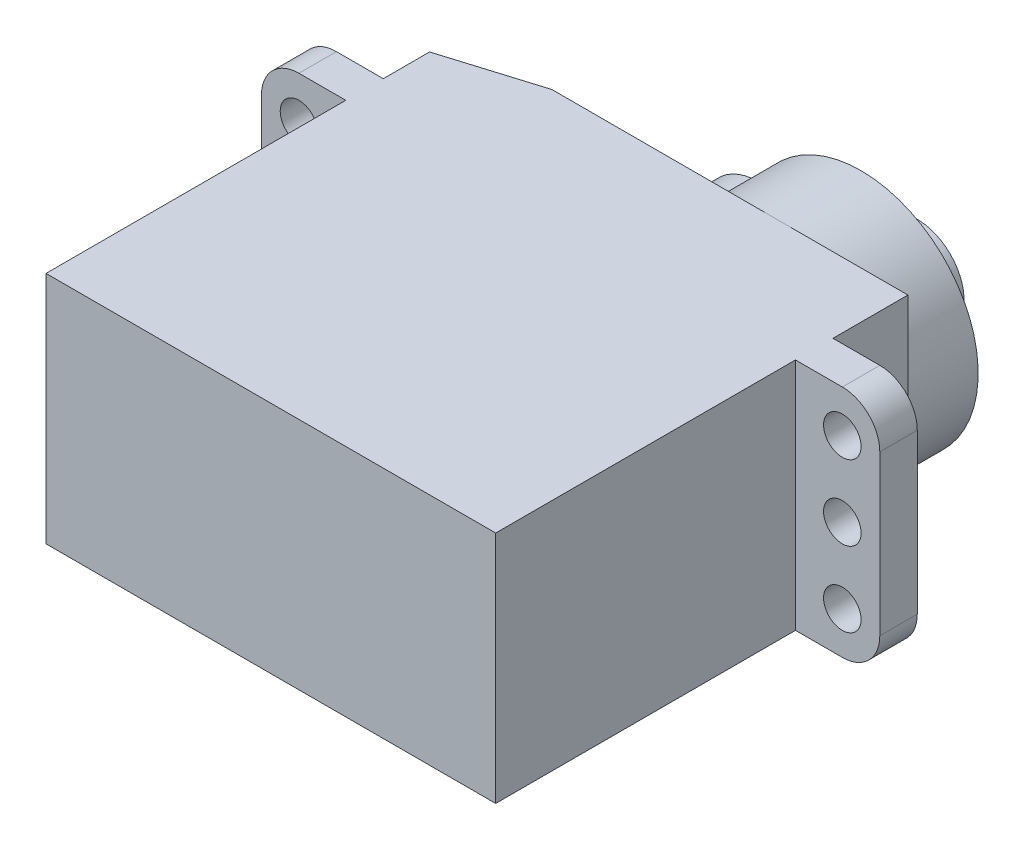
ISO-10303-21;
HEADER;
FILE_DESCRIPTION(('STEP AP214'),'2;1');
FILE_NAME('part.step','',(''),(''),'','','');
FILE_SCHEMA(('AUTOMOTIVE_DESIGN { 1 0 10303 214 1 1 1 1 }'));
ENDSEC;
DATA;
#1=APPLICATION_CONTEXT('core data for automotive mechanical design processes');
#2=APPLICATION_PROTOCOL_DEFINITION('international standard','automotive_design',2000,#1);
#3=PRODUCT_CONTEXT('',#1,'mechanical');
#4=PRODUCT('Part','Part','',(#3));
#5=PRODUCT_RELATED_PRODUCT_CATEGORY('part','',(#4));
#6=PRODUCT_DEFINITION_FORMATION('','',#4);
#7=PRODUCT_DEFINITION_CONTEXT('part definition',#1,'design');
#8=PRODUCT_DEFINITION('design','',#6,#7);
#9=PRODUCT_DEFINITION_SHAPE('','',#8);
#10=(LENGTH_UNIT() NAMED_UNIT(*) SI_UNIT(.MILLI.,.METRE.));
#11=(NAMED_UNIT(*) PLANE_ANGLE_UNIT() SI_UNIT($,.RADIAN.));
#12=(NAMED_UNIT(*) SI_UNIT($,.STERADIAN.) SOLID_ANGLE_UNIT());
#13=UNCERTAINTY_MEASURE_WITH_UNIT(LENGTH_MEASURE(1.E-05),#10,'distance_accuracy_value','');
#14=(GEOMETRIC_REPRESENTATION_CONTEXT(3) GLOBAL_UNCERTAINTY_ASSIGNED_CONTEXT((#13)) GLOBAL_UNIT_ASSIGNED_CONTEXT((#10,
#11,#12)) REPRESENTATION_CONTEXT('',''));
#15=CARTESIAN_POINT('',(0.,0.,0.));
#16=DIRECTION('',(0.,0.,1.));
#17=DIRECTION('',(1.,0.,0.));
#18=AXIS2_PLACEMENT_3D('',#15,#16,#17);
#19=CARTESIAN_POINT('',(-12.,12.5,-22.));
#20=DIRECTION('',(0.,0.,1.));
#21=DIRECTION('',(1.,0.,0.));
#22=AXIS2_PLACEMENT_3D('',#19,#20,#21);
#23=PLANE('',#22);
#24=DIRECTION('',(-1.,0.,0.));
#25=VECTOR('',#24,1.);
#26=CARTESIAN_POINT('',(-12.,0.,-22.));
#27=LINE('',#26,#25);
#28=CARTESIAN_POINT('',(5.,0.,-22.));
#29=VERTEX_POINT('',#28);
#30=CARTESIAN_POINT('',(-6.99999999999994,0.,-22.));
#31=VERTEX_POINT('',#30);
#32=EDGE_CURVE('E240',#29,#31,#27,.T.);
#33=ORIENTED_EDGE('',*,*,#32,.T.);
#34=DIRECTION('',(0.,1.,0.));
#35=VECTOR('',#34,1.);
#36=CARTESIAN_POINT('',(-6.99999999999994,12.5,-22.));
#37=LINE('',#36,#35);
#38=CARTESIAN_POINT('',(-6.99999999999994,12.5,-22.));
#39=VERTEX_POINT('',#38);
#40=EDGE_CURVE('E47',#31,#39,#37,.T.);
#41=ORIENTED_EDGE('',*,*,#40,.T.);
#42=DIRECTION('',(-1.,0.,0.));
#43=VECTOR('',#42,1.);
#44=CARTESIAN_POINT('',(-12.,12.5,-22.));
#45=LINE('',#44,#43);
#46=CARTESIAN_POINT('',(5.,12.5,-22.));
#47=VERTEX_POINT('',#46);
#48=EDGE_CURVE('E218',#47,#39,#45,.T.);
#49=ORIENTED_EDGE('',*,*,#48,.F.);
#50=CARTESIAN_POINT('',(5.,6.25,-22.));
#51=DIRECTION('',(0.,0.,-1.));
#52=DIRECTION('',(-1.,0.,0.));
#53=AXIS2_PLACEMENT_3D('',#50,#51,#52);
#54=CIRCLE('',#53,6.25);
#55=CARTESIAN_POINT('',(-0.482928049865331,9.25,-22.));
#56=VERTEX_POINT('',#55);
#57=EDGE_CURVE('E391',#56,#47,#54,.T.);
#58=ORIENTED_EDGE('',*,*,#57,.F.);
#59=CARTESIAN_POINT('',(-0.482928049865331,6.25,-22.));
#60=DIRECTION('',(0.,0.,-1.));
#61=DIRECTION('',(-1.,0.,0.));
#62=AXIS2_PLACEMENT_3D('',#59,#60,#61);
#63=CIRCLE('',#62,3.);
#64=CARTESIAN_POINT('',(-0.48292804986533,3.25,-22.));
#65=VERTEX_POINT('',#64);
#66=EDGE_CURVE('E190',#65,#56,#63,.T.);
#67=ORIENTED_EDGE('',*,*,#66,.F.);
#68=EDGE_CURVE('E196',#29,#65,#54,.T.);
#69=ORIENTED_EDGE('',*,*,#68,.F.);
#70=EDGE_LOOP('',(#33,#41,#49,#58,#67,#69));
#71=FACE_BOUND('',#70,.T.);
#72=ADVANCED_FACE('F39',(#71),#23,.F.);
#73=CARTESIAN_POINT('',(12.,12.5,0.));
#74=DIRECTION('',(0.,0.,-1.));
#75=DIRECTION('',(-1.,0.,0.));
#76=AXIS2_PLACEMENT_3D('',#73,#74,#75);
#77=PLANE('',#76);
#78=DIRECTION('',(1.,0.,0.));
#79=VECTOR('',#78,1.);
#80=CARTESIAN_POINT('',(12.,0.,0.));
#81=LINE('',#80,#79);
#82=CARTESIAN_POINT('',(-12.,0.,0.));
#83=VERTEX_POINT('',#82);
#84=CARTESIAN_POINT('',(12.,0.,0.));
#85=VERTEX_POINT('',#84);
#86=EDGE_CURVE('E197',#83,#85,#81,.T.);
#87=ORIENTED_EDGE('',*,*,#86,.T.);
#88=DIRECTION('',(0.,-1.,0.));
#89=VECTOR('',#88,1.);
#90=CARTESIAN_POINT('',(12.,12.5,0.));
#91=LINE('',#90,#89);
#92=CARTESIAN_POINT('',(12.,12.5,0.));
#93=VERTEX_POINT('',#92);
#94=EDGE_CURVE('E281',#93,#85,#91,.T.);
#95=ORIENTED_EDGE('',*,*,#94,.F.);
#96=DIRECTION('',(1.,0.,0.));
#97=VECTOR('',#96,1.);
#98=CARTESIAN_POINT('',(12.,12.5,0.));
#99=LINE('',#98,#97);
#100=CARTESIAN_POINT('',(-12.,12.5,0.));
#101=VERTEX_POINT('',#100);
#102=EDGE_CURVE('E205',#101,#93,#99,.T.);
#103=ORIENTED_EDGE('',*,*,#102,.F.);
#104=DIRECTION('',(0.,-1.,0.));
#105=VECTOR('',#104,1.);
#106=CARTESIAN_POINT('',(-12.,12.5,0.));
#107=LINE('',#106,#105);
#108=EDGE_CURVE('E230',#101,#83,#107,.T.);
#109=ORIENTED_EDGE('',*,*,#108,.T.);
#110=EDGE_LOOP('',(#87,#95,#103,#109));
#111=FACE_BOUND('',#110,.T.);
#112=ADVANCED_FACE('F368',(#111),#77,.F.);
#113=CARTESIAN_POINT('',(12.,12.5,-16.));
#114=DIRECTION('',(-1.,0.,0.));
#115=DIRECTION('',(0.,0.,1.));
#116=AXIS2_PLACEMENT_3D('',#113,#114,#115);
#117=PLANE('',#116);
#118=DIRECTION('',(0.,0.,-1.));
#119=VECTOR('',#118,1.);
#120=CARTESIAN_POINT('',(12.,0.,-16.));
#121=LINE('',#120,#119);
#122=CARTESIAN_POINT('',(12.,0.,-16.));
#123=VERTEX_POINT('',#122);
#124=EDGE_CURVE('E200',#85,#123,#121,.T.);
#125=ORIENTED_EDGE('',*,*,#124,.T.);
#126=DIRECTION('',(0.,-1.,0.));
#127=VECTOR('',#126,1.);
#128=CARTESIAN_POINT('',(12.,12.5,-16.));
#129=LINE('',#128,#127);
#130=CARTESIAN_POINT('',(12.,12.5,-16.));
#131=VERTEX_POINT('',#130);
#132=EDGE_CURVE('E278',#131,#123,#129,.T.);
#133=ORIENTED_EDGE('',*,*,#132,.F.);
#134=DIRECTION('',(0.,0.,-1.));
#135=VECTOR('',#134,1.);
#136=CARTESIAN_POINT('',(12.,12.5,-16.));
#137=LINE('',#136,#135);
#138=EDGE_CURVE('E208',#93,#131,#137,.T.);
#139=ORIENTED_EDGE('',*,*,#138,.F.);
#140=ORIENTED_EDGE('',*,*,#94,.T.);
#141=EDGE_LOOP('',(#125,#133,#139,#140));
#142=FACE_BOUND('',#141,.T.);
#143=ADVANCED_FACE('F374',(#142),#117,.F.);
#144=CARTESIAN_POINT('',(16.5,12.5,-16.));
#145=DIRECTION('',(0.,0.,-1.));
#146=DIRECTION('',(-1.,0.,0.));
#147=AXIS2_PLACEMENT_3D('',#144,#145,#146);
#148=PLANE('',#147);
#149=CARTESIAN_POINT('',(14.5,10.25,-16.));
#150=DIRECTION('',(0.,0.,-1.));
#151=DIRECTION('',(-1.,0.,0.));
#152=AXIS2_PLACEMENT_3D('',#149,#150,#151);
#153=CIRCLE('',#152,1.);
#154=CARTESIAN_POINT('',(13.5,10.25,-16.));
#155=VERTEX_POINT('',#154);
#156=EDGE_CURVE('E410',#155,#155,#153,.F.);
#157=ORIENTED_EDGE('',*,*,#156,.F.);
#158=EDGE_LOOP('',(#157));
#159=FACE_BOUND('',#158,.T.);
#160=CARTESIAN_POINT('',(14.5,2.25,-16.));
#161=DIRECTION('',(0.,0.,-1.));
#162=DIRECTION('',(-1.,0.,0.));
#163=AXIS2_PLACEMENT_3D('',#160,#161,#162);
#164=CIRCLE('',#163,1.);
#165=CARTESIAN_POINT('',(13.5,2.25,-16.));
#166=VERTEX_POINT('',#165);
#167=EDGE_CURVE('E411',#166,#166,#164,.F.);
#168=ORIENTED_EDGE('',*,*,#167,.F.);
#169=EDGE_LOOP('',(#168));
#170=FACE_BOUND('',#169,.T.);
#171=CARTESIAN_POINT('',(14.5,6.25,-16.));
#172=DIRECTION('',(0.,0.,-1.));
#173=DIRECTION('',(-1.,0.,0.));
#174=AXIS2_PLACEMENT_3D('',#171,#172,#173);
#175=CIRCLE('',#174,1.);
#176=CARTESIAN_POINT('',(13.5,6.25,-16.));
#177=VERTEX_POINT('',#176);
#178=EDGE_CURVE('E404',#177,#177,#175,.F.);
#179=ORIENTED_EDGE('',*,*,#178,.F.);
#180=EDGE_LOOP('',(#179));
#181=FACE_BOUND('',#180,.T.);
#182=DIRECTION('',(1.,0.,0.));
#183=VECTOR('',#182,1.);
#184=CARTESIAN_POINT('',(16.5,0.,-16.));
#185=LINE('',#184,#183);
#186=CARTESIAN_POINT('',(14.5,0.,-16.));
#187=VERTEX_POINT('',#186);
#188=EDGE_CURVE('E233',#123,#187,#185,.T.);
#189=ORIENTED_EDGE('',*,*,#188,.T.);
#190=CARTESIAN_POINT('',(14.5,2.,-16.));
#191=DIRECTION('',(0.,0.,-1.));
#192=DIRECTION('',(-1.,0.,0.));
#193=AXIS2_PLACEMENT_3D('',#190,#191,#192);
#194=CIRCLE('',#193,2.);
#195=CARTESIAN_POINT('',(16.5,2.,-16.));
#196=VERTEX_POINT('',#195);
#197=EDGE_CURVE('E322',#187,#196,#194,.F.);
#198=ORIENTED_EDGE('',*,*,#197,.T.);
#199=DIRECTION('',(0.,-1.,0.));
#200=VECTOR('',#199,1.);
#201=CARTESIAN_POINT('',(16.5,12.5,-16.));
#202=LINE('',#201,#200);
#203=CARTESIAN_POINT('',(16.5,10.5,-16.));
#204=VERTEX_POINT('',#203);
#205=EDGE_CURVE('E275',#204,#196,#202,.T.);
#206=ORIENTED_EDGE('',*,*,#205,.F.);
#207=CARTESIAN_POINT('',(14.5,10.5,-16.));
#208=DIRECTION('',(0.,0.,-1.));
#209=DIRECTION('',(-1.,0.,0.));
#210=AXIS2_PLACEMENT_3D('',#207,#208,#209);
#211=CIRCLE('',#210,2.);
#212=CARTESIAN_POINT('',(14.5,12.5,-16.));
#213=VERTEX_POINT('',#212);
#214=EDGE_CURVE('E320',#204,#213,#211,.F.);
#215=ORIENTED_EDGE('',*,*,#214,.T.);
#216=DIRECTION('',(1.,0.,0.));
#217=VECTOR('',#216,1.);
#218=CARTESIAN_POINT('',(16.5,12.5,-16.));
#219=LINE('',#218,#217);
#220=EDGE_CURVE('E211',#131,#213,#219,.T.);
#221=ORIENTED_EDGE('',*,*,#220,.F.);
#222=ORIENTED_EDGE('',*,*,#132,.T.);
#223=EDGE_LOOP('',(#189,#198,#206,#215,#221,#222));
#224=FACE_BOUND('',#223,.T.);
#225=ADVANCED_FACE('F603',(#159,#170,#181,#224),#148,.F.);
#226=CARTESIAN_POINT('',(16.5,12.5,-18.));
#227=DIRECTION('',(-1.,0.,0.));
#228=DIRECTION('',(0.,0.,1.));
#229=AXIS2_PLACEMENT_3D('',#226,#227,#228);
#230=PLANE('',#229);
#231=ORIENTED_EDGE('',*,*,#205,.T.);
#232=DIRECTION('',(0.,0.,-1.));
#233=VECTOR('',#232,1.);
#234=CARTESIAN_POINT('',(16.5,2.,-18.));
#235=LINE('',#234,#233);
#236=CARTESIAN_POINT('',(16.5,2.,-18.));
#237=VERTEX_POINT('',#236);
#238=EDGE_CURVE('E313',#196,#237,#235,.T.);
#239=ORIENTED_EDGE('',*,*,#238,.T.);
#240=DIRECTION('',(0.,-1.,0.));
#241=VECTOR('',#240,1.);
#242=CARTESIAN_POINT('',(16.5,12.5,-18.));
#243=LINE('',#242,#241);
#244=CARTESIAN_POINT('',(16.5,10.5,-18.));
#245=VERTEX_POINT('',#244);
#246=EDGE_CURVE('E272',#245,#237,#243,.T.);
#247=ORIENTED_EDGE('',*,*,#246,.F.);
#248=DIRECTION('',(0.,0.,-1.));
#249=VECTOR('',#248,1.);
#250=CARTESIAN_POINT('',(16.5,10.5,-18.));
#251=LINE('',#250,#249);
#252=EDGE_CURVE('E311',#245,#204,#251,.F.);
#253=ORIENTED_EDGE('',*,*,#252,.T.);
#254=EDGE_LOOP('',(#231,#239,#247,#253));
#255=FACE_BOUND('',#254,.T.);
#256=ADVANCED_FACE('F608',(#255),#230,.F.);
#257=CARTESIAN_POINT('',(12.,12.5,-18.));
#258=DIRECTION('',(0.,0.,1.));
#259=DIRECTION('',(1.,0.,0.));
#260=AXIS2_PLACEMENT_3D('',#257,#258,#259);
#261=PLANE('',#260);
#262=CARTESIAN_POINT('',(14.5,10.25,-18.));
#263=DIRECTION('',(0.,0.,-1.));
#264=DIRECTION('',(-1.,0.,0.));
#265=AXIS2_PLACEMENT_3D('',#262,#263,#264);
#266=CIRCLE('',#265,1.);
#267=CARTESIAN_POINT('',(13.5,10.25,-18.));
#268=VERTEX_POINT('',#267);
#269=EDGE_CURVE('E414',#268,#268,#266,.T.);
#270=ORIENTED_EDGE('',*,*,#269,.F.);
#271=EDGE_LOOP('',(#270));
#272=FACE_BOUND('',#271,.T.);
#273=CARTESIAN_POINT('',(14.5,2.25,-18.));
#274=DIRECTION('',(0.,0.,-1.));
#275=DIRECTION('',(-1.,0.,0.));
#276=AXIS2_PLACEMENT_3D('',#273,#274,#275);
#277=CIRCLE('',#276,1.);
#278=CARTESIAN_POINT('',(13.5,2.25,-18.));
#279=VERTEX_POINT('',#278);
#280=EDGE_CURVE('E415',#279,#279,#277,.T.);
#281=ORIENTED_EDGE('',*,*,#280,.F.);
#282=EDGE_LOOP('',(#281));
#283=FACE_BOUND('',#282,.T.);
#284=CARTESIAN_POINT('',(14.5,6.25,-18.));
#285=DIRECTION('',(0.,0.,-1.));
#286=DIRECTION('',(-1.,0.,0.));
#287=AXIS2_PLACEMENT_3D('',#284,#285,#286);
#288=CIRCLE('',#287,1.);
#289=CARTESIAN_POINT('',(13.5,6.25,-18.));
#290=VERTEX_POINT('',#289);
#291=EDGE_CURVE('E407',#290,#290,#288,.T.);
#292=ORIENTED_EDGE('',*,*,#291,.F.);
#293=EDGE_LOOP('',(#292));
#294=FACE_BOUND('',#293,.T.);
#295=ORIENTED_EDGE('',*,*,#246,.T.);
#296=CARTESIAN_POINT('',(14.5,2.,-18.));
#297=DIRECTION('',(0.,0.,1.));
#298=DIRECTION('',(1.,0.,0.));
#299=AXIS2_PLACEMENT_3D('',#296,#297,#298);
#300=CIRCLE('',#299,2.);
#301=CARTESIAN_POINT('',(14.5,0.,-18.));
#302=VERTEX_POINT('',#301);
#303=EDGE_CURVE('E318',#237,#302,#300,.F.);
#304=ORIENTED_EDGE('',*,*,#303,.T.);
#305=DIRECTION('',(-1.,0.,0.));
#306=VECTOR('',#305,1.);
#307=CARTESIAN_POINT('',(12.,0.,-18.));
#308=LINE('',#307,#306);
#309=CARTESIAN_POINT('',(12.,0.,-18.));
#310=VERTEX_POINT('',#309);
#311=EDGE_CURVE('E236',#302,#310,#308,.T.);
#312=ORIENTED_EDGE('',*,*,#311,.T.);
#313=DIRECTION('',(0.,-1.,0.));
#314=VECTOR('',#313,1.);
#315=CARTESIAN_POINT('',(12.,12.5,-18.));
#316=LINE('',#315,#314);
#317=CARTESIAN_POINT('',(12.,12.5,-18.));
#318=VERTEX_POINT('',#317);
#319=EDGE_CURVE('E269',#318,#310,#316,.T.);
#320=ORIENTED_EDGE('',*,*,#319,.F.);
#321=DIRECTION('',(-1.,0.,0.));
#322=VECTOR('',#321,1.);
#323=CARTESIAN_POINT('',(12.,12.5,-18.));
#324=LINE('',#323,#322);
#325=CARTESIAN_POINT('',(14.5,12.5,-18.));
#326=VERTEX_POINT('',#325);
#327=EDGE_CURVE('E214',#326,#318,#324,.T.);
#328=ORIENTED_EDGE('',*,*,#327,.F.);
#329=CARTESIAN_POINT('',(14.5,10.5,-18.));
#330=DIRECTION('',(0.,0.,1.));
#331=DIRECTION('',(1.,0.,0.));
#332=AXIS2_PLACEMENT_3D('',#329,#330,#331);
#333=CIRCLE('',#332,2.);
#334=EDGE_CURVE('E316',#326,#245,#333,.F.);
#335=ORIENTED_EDGE('',*,*,#334,.T.);
#336=EDGE_LOOP('',(#295,#304,#312,#320,#328,#335));
#337=FACE_BOUND('',#336,.T.);
#338=ADVANCED_FACE('F386',(#272,#283,#294,#337),#261,.F.);
#339=CARTESIAN_POINT('',(12.,12.5,-22.));
#340=DIRECTION('',(-1.,0.,0.));
#341=DIRECTION('',(0.,0.,1.));
#342=AXIS2_PLACEMENT_3D('',#339,#340,#341);
#343=PLANE('',#342);
#344=DIRECTION('',(0.,0.,-1.));
#345=VECTOR('',#344,1.);
#346=CARTESIAN_POINT('',(12.,0.,-22.));
#347=LINE('',#346,#345);
#348=CARTESIAN_POINT('',(12.,0.,-22.));
#349=VERTEX_POINT('',#348);
#350=EDGE_CURVE('E238',#310,#349,#347,.T.);
#351=ORIENTED_EDGE('',*,*,#350,.T.);
#352=DIRECTION('',(0.,-1.,0.));
#353=VECTOR('',#352,1.);
#354=CARTESIAN_POINT('',(12.,12.5,-22.));
#355=LINE('',#354,#353);
#356=CARTESIAN_POINT('',(12.,12.5,-22.));
#357=VERTEX_POINT('',#356);
#358=EDGE_CURVE('E266',#357,#349,#355,.T.);
#359=ORIENTED_EDGE('',*,*,#358,.F.);
#360=DIRECTION('',(0.,0.,-1.));
#361=VECTOR('',#360,1.);
#362=CARTESIAN_POINT('',(12.,12.5,-22.));
#363=LINE('',#362,#361);
#364=EDGE_CURVE('E216',#318,#357,#363,.T.);
#365=ORIENTED_EDGE('',*,*,#364,.F.);
#366=ORIENTED_EDGE('',*,*,#319,.T.);
#367=EDGE_LOOP('',(#351,#359,#365,#366));
#368=FACE_BOUND('',#367,.T.);
#369=ADVANCED_FACE('F380',(#368),#343,.F.);
#370=EDGE_CURVE('E288',#47,#29,#54,.T.);
#371=ORIENTED_EDGE('',*,*,#370,.F.);
#372=EDGE_CURVE('E219',#357,#47,#45,.T.);
#373=ORIENTED_EDGE('',*,*,#372,.F.);
#374=ORIENTED_EDGE('',*,*,#358,.T.);
#375=EDGE_CURVE('E241',#349,#29,#27,.T.);
#376=ORIENTED_EDGE('',*,*,#375,.T.);
#377=EDGE_LOOP('',(#371,#373,#374,#376));
#378=FACE_BOUND('',#377,.T.);
#379=ADVANCED_FACE('F370',(#378),#23,.F.);
#380=CARTESIAN_POINT('',(-12.,12.5,-18.));
#381=DIRECTION('',(1.,0.,0.));
#382=DIRECTION('',(0.,0.,-1.));
#383=AXIS2_PLACEMENT_3D('',#380,#381,#382);
#384=PLANE('',#383);
#385=DIRECTION('',(0.,0.,1.));
#386=VECTOR('',#385,1.);
#387=CARTESIAN_POINT('',(-12.,12.5,-18.));
#388=LINE('',#387,#386);
#389=CARTESIAN_POINT('',(-12.,12.5,-20.4713465927067));
#390=VERTEX_POINT('',#389);
#391=CARTESIAN_POINT('',(-12.,12.5,-18.));
#392=VERTEX_POINT('',#391);
#393=EDGE_CURVE('E222',#390,#392,#388,.T.);
#394=ORIENTED_EDGE('',*,*,#393,.F.);
#395=DIRECTION('',(0.,-1.,0.));
#396=VECTOR('',#395,1.);
#397=CARTESIAN_POINT('',(-12.,12.5,-20.4713465927067));
#398=LINE('',#397,#396);
#399=CARTESIAN_POINT('',(-12.,0.,-20.4713465927067));
#400=VERTEX_POINT('',#399);
#401=EDGE_CURVE('E324',#390,#400,#398,.T.);
#402=ORIENTED_EDGE('',*,*,#401,.T.);
#403=DIRECTION('',(0.,0.,1.));
#404=VECTOR('',#403,1.);
#405=CARTESIAN_POINT('',(-12.,0.,-18.));
#406=LINE('',#405,#404);
#407=CARTESIAN_POINT('',(-12.,0.,-18.));
#408=VERTEX_POINT('',#407);
#409=EDGE_CURVE('E244',#400,#408,#406,.T.);
#410=ORIENTED_EDGE('',*,*,#409,.T.);
#411=DIRECTION('',(0.,-1.,0.));
#412=VECTOR('',#411,1.);
#413=CARTESIAN_POINT('',(-12.,12.5,-18.));
#414=LINE('',#413,#412);
#415=EDGE_CURVE('E263',#392,#408,#414,.T.);
#416=ORIENTED_EDGE('',*,*,#415,.F.);
#417=EDGE_LOOP('',(#394,#402,#410,#416));
#418=FACE_BOUND('',#417,.T.);
#419=ADVANCED_FACE('F330',(#418),#384,.F.);
#420=CARTESIAN_POINT('',(-16.5,12.5,-18.));
#421=DIRECTION('',(0.,0.,1.));
#422=DIRECTION('',(1.,0.,0.));
#423=AXIS2_PLACEMENT_3D('',#420,#421,#422);
#424=PLANE('',#423);
#425=CARTESIAN_POINT('',(-14.5,10.25,-18.));
#426=DIRECTION('',(0.,0.,1.));
#427=DIRECTION('',(1.,0.,0.));
#428=AXIS2_PLACEMENT_3D('',#425,#426,#427);
#429=CIRCLE('',#428,1.);
#430=CARTESIAN_POINT('',(-13.5,10.25,-18.));
#431=VERTEX_POINT('',#430);
#432=EDGE_CURVE('E426',#431,#431,#429,.T.);
#433=ORIENTED_EDGE('',*,*,#432,.T.);
#434=EDGE_LOOP('',(#433));
#435=FACE_BOUND('',#434,.T.);
#436=CARTESIAN_POINT('',(-14.5,2.25,-18.));
#437=DIRECTION('',(0.,0.,1.));
#438=DIRECTION('',(1.,0.,0.));
#439=AXIS2_PLACEMENT_3D('',#436,#437,#438);
#440=CIRCLE('',#439,1.);
#441=CARTESIAN_POINT('',(-13.5,2.25,-18.));
#442=VERTEX_POINT('',#441);
#443=EDGE_CURVE('E432',#442,#442,#440,.T.);
#444=ORIENTED_EDGE('',*,*,#443,.T.);
#445=EDGE_LOOP('',(#444));
#446=FACE_BOUND('',#445,.T.);
#447=CARTESIAN_POINT('',(-14.5,6.25,-18.));
#448=DIRECTION('',(0.,0.,1.));
#449=DIRECTION('',(1.,0.,0.));
#450=AXIS2_PLACEMENT_3D('',#447,#448,#449);
#451=CIRCLE('',#450,1.);
#452=CARTESIAN_POINT('',(-13.5,6.25,-18.));
#453=VERTEX_POINT('',#452);
#454=EDGE_CURVE('E418',#453,#453,#451,.T.);
#455=ORIENTED_EDGE('',*,*,#454,.T.);
#456=EDGE_LOOP('',(#455));
#457=FACE_BOUND('',#456,.T.);
#458=DIRECTION('',(-1.,0.,0.));
#459=VECTOR('',#458,1.);
#460=CARTESIAN_POINT('',(-16.5,0.,-18.));
#461=LINE('',#460,#459);
#462=CARTESIAN_POINT('',(-14.5,0.,-18.));
#463=VERTEX_POINT('',#462);
#464=EDGE_CURVE('E246',#408,#463,#461,.T.);
#465=ORIENTED_EDGE('',*,*,#464,.T.);
#466=CARTESIAN_POINT('',(-14.5,2.,-18.));
#467=DIRECTION('',(0.,0.,1.));
#468=DIRECTION('',(1.,0.,0.));
#469=AXIS2_PLACEMENT_3D('',#466,#467,#468);
#470=CIRCLE('',#469,2.);
#471=CARTESIAN_POINT('',(-16.5,2.,-18.));
#472=VERTEX_POINT('',#471);
#473=EDGE_CURVE('E303',#463,#472,#470,.F.);
#474=ORIENTED_EDGE('',*,*,#473,.T.);
#475=DIRECTION('',(0.,-1.,0.));
#476=VECTOR('',#475,1.);
#477=CARTESIAN_POINT('',(-16.5,12.5,-18.));
#478=LINE('',#477,#476);
#479=CARTESIAN_POINT('',(-16.5,10.5,-18.));
#480=VERTEX_POINT('',#479);
#481=EDGE_CURVE('E260',#480,#472,#478,.T.);
#482=ORIENTED_EDGE('',*,*,#481,.F.);
#483=CARTESIAN_POINT('',(-14.5,10.5,-18.));
#484=DIRECTION('',(0.,0.,1.));
#485=DIRECTION('',(1.,0.,0.));
#486=AXIS2_PLACEMENT_3D('',#483,#484,#485);
#487=CIRCLE('',#486,2.);
#488=CARTESIAN_POINT('',(-14.5,12.5,-18.));
#489=VERTEX_POINT('',#488);
#490=EDGE_CURVE('E301',#480,#489,#487,.F.);
#491=ORIENTED_EDGE('',*,*,#490,.T.);
#492=DIRECTION('',(-1.,0.,0.));
#493=VECTOR('',#492,1.);
#494=CARTESIAN_POINT('',(-16.5,12.5,-18.));
#495=LINE('',#494,#493);
#496=EDGE_CURVE('E224',#392,#489,#495,.T.);
#497=ORIENTED_EDGE('',*,*,#496,.F.);
#498=ORIENTED_EDGE('',*,*,#415,.T.);
#499=EDGE_LOOP('',(#465,#474,#482,#491,#497,#498));
#500=FACE_BOUND('',#499,.T.);
#501=ADVANCED_FACE('F340',(#435,#446,#457,#500),#424,.F.);
#502=CARTESIAN_POINT('',(-16.5,12.5,-16.));
#503=DIRECTION('',(1.,0.,0.));
#504=DIRECTION('',(0.,0.,-1.));
#505=AXIS2_PLACEMENT_3D('',#502,#503,#504);
#506=PLANE('',#505);
#507=ORIENTED_EDGE('',*,*,#481,.T.);
#508=DIRECTION('',(0.,0.,1.));
#509=VECTOR('',#508,1.);
#510=CARTESIAN_POINT('',(-16.5,2.,-16.));
#511=LINE('',#510,#509);
#512=CARTESIAN_POINT('',(-16.5,2.,-16.));
#513=VERTEX_POINT('',#512);
#514=EDGE_CURVE('E290',#472,#513,#511,.T.);
#515=ORIENTED_EDGE('',*,*,#514,.T.);
#516=DIRECTION('',(0.,-1.,0.));
#517=VECTOR('',#516,1.);
#518=CARTESIAN_POINT('',(-16.5,12.5,-16.));
#519=LINE('',#518,#517);
#520=CARTESIAN_POINT('',(-16.5,10.5,-16.));
#521=VERTEX_POINT('',#520);
#522=EDGE_CURVE('E257',#521,#513,#519,.T.);
#523=ORIENTED_EDGE('',*,*,#522,.F.);
#524=DIRECTION('',(0.,0.,1.));
#525=VECTOR('',#524,1.);
#526=CARTESIAN_POINT('',(-16.5,10.5,-16.));
#527=LINE('',#526,#525);
#528=EDGE_CURVE('E287',#521,#480,#527,.F.);
#529=ORIENTED_EDGE('',*,*,#528,.T.);
#530=EDGE_LOOP('',(#507,#515,#523,#529));
#531=FACE_BOUND('',#530,.T.);
#532=ADVANCED_FACE('F348',(#531),#506,.F.);
#533=CARTESIAN_POINT('',(-12.,12.5,-16.));
#534=DIRECTION('',(0.,0.,-1.));
#535=DIRECTION('',(-1.,0.,0.));
#536=AXIS2_PLACEMENT_3D('',#533,#534,#535);
#537=PLANE('',#536);
#538=CARTESIAN_POINT('',(-14.5,10.25,-16.));
#539=DIRECTION('',(0.,0.,-1.));
#540=DIRECTION('',(-1.,0.,0.));
#541=AXIS2_PLACEMENT_3D('',#538,#539,#540);
#542=CIRCLE('',#541,1.);
#543=CARTESIAN_POINT('',(-15.5,10.25,-16.));
#544=VERTEX_POINT('',#543);
#545=EDGE_CURVE('E435',#544,#544,#542,.T.);
#546=ORIENTED_EDGE('',*,*,#545,.T.);
#547=EDGE_LOOP('',(#546));
#548=FACE_BOUND('',#547,.T.);
#549=CARTESIAN_POINT('',(-14.5,2.25,-16.));
#550=DIRECTION('',(0.,0.,-1.));
#551=DIRECTION('',(-1.,0.,0.));
#552=AXIS2_PLACEMENT_3D('',#549,#550,#551);
#553=CIRCLE('',#552,1.);
#554=CARTESIAN_POINT('',(-15.5,2.25,-16.));
#555=VERTEX_POINT('',#554);
#556=EDGE_CURVE('E429',#555,#555,#553,.T.);
#557=ORIENTED_EDGE('',*,*,#556,.T.);
#558=EDGE_LOOP('',(#557));
#559=FACE_BOUND('',#558,.T.);
#560=CARTESIAN_POINT('',(-14.5,6.25,-16.));
#561=DIRECTION('',(0.,0.,-1.));
#562=DIRECTION('',(-1.,0.,0.));
#563=AXIS2_PLACEMENT_3D('',#560,#561,#562);
#564=CIRCLE('',#563,1.);
#565=CARTESIAN_POINT('',(-15.5,6.25,-16.));
#566=VERTEX_POINT('',#565);
#567=EDGE_CURVE('E423',#566,#566,#564,.T.);
#568=ORIENTED_EDGE('',*,*,#567,.T.);
#569=EDGE_LOOP('',(#568));
#570=FACE_BOUND('',#569,.T.);
#571=ORIENTED_EDGE('',*,*,#522,.T.);
#572=CARTESIAN_POINT('',(-14.5,2.,-16.));
#573=DIRECTION('',(0.,0.,-1.));
#574=DIRECTION('',(-1.,0.,0.));
#575=AXIS2_PLACEMENT_3D('',#572,#573,#574);
#576=CIRCLE('',#575,2.);
#577=CARTESIAN_POINT('',(-14.5,0.,-16.));
#578=VERTEX_POINT('',#577);
#579=EDGE_CURVE('E295',#513,#578,#576,.F.);
#580=ORIENTED_EDGE('',*,*,#579,.T.);
#581=DIRECTION('',(1.,0.,0.));
#582=VECTOR('',#581,1.);
#583=CARTESIAN_POINT('',(-12.,0.,-16.));
#584=LINE('',#583,#582);
#585=CARTESIAN_POINT('',(-12.,0.,-16.));
#586=VERTEX_POINT('',#585);
#587=EDGE_CURVE('E249',#578,#586,#584,.T.);
#588=ORIENTED_EDGE('',*,*,#587,.T.);
#589=DIRECTION('',(0.,-1.,0.));
#590=VECTOR('',#589,1.);
#591=CARTESIAN_POINT('',(-12.,12.5,-16.));
#592=LINE('',#591,#590);
#593=CARTESIAN_POINT('',(-12.,12.5,-16.));
#594=VERTEX_POINT('',#593);
#595=EDGE_CURVE('E254',#594,#586,#592,.T.);
#596=ORIENTED_EDGE('',*,*,#595,.F.);
#597=DIRECTION('',(1.,0.,0.));
#598=VECTOR('',#597,1.);
#599=CARTESIAN_POINT('',(-12.,12.5,-16.));
#600=LINE('',#599,#598);
#601=CARTESIAN_POINT('',(-14.5,12.5,-16.));
#602=VERTEX_POINT('',#601);
#603=EDGE_CURVE('E227',#602,#594,#600,.T.);
#604=ORIENTED_EDGE('',*,*,#603,.F.);
#605=CARTESIAN_POINT('',(-14.5,10.5,-16.));
#606=DIRECTION('',(0.,0.,-1.));
#607=DIRECTION('',(-1.,0.,0.));
#608=AXIS2_PLACEMENT_3D('',#605,#606,#607);
#609=CIRCLE('',#608,2.);
#610=EDGE_CURVE('E293',#602,#521,#609,.F.);
#611=ORIENTED_EDGE('',*,*,#610,.T.);
#612=EDGE_LOOP('',(#571,#580,#588,#596,#604,#611));
#613=FACE_BOUND('',#612,.T.);
#614=ADVANCED_FACE('F351',(#548,#559,#570,#613),#537,.F.);
#615=CARTESIAN_POINT('',(-12.,12.5,0.));
#616=DIRECTION('',(1.,0.,0.));
#617=DIRECTION('',(0.,0.,-1.));
#618=AXIS2_PLACEMENT_3D('',#615,#616,#617);
#619=PLANE('',#618);
#620=DIRECTION('',(0.,0.,1.));
#621=VECTOR('',#620,1.);
#622=CARTESIAN_POINT('',(-12.,0.,0.));
#623=LINE('',#622,#621);
#624=EDGE_CURVE('E209',#586,#83,#623,.T.);
#625=ORIENTED_EDGE('',*,*,#624,.T.);
#626=ORIENTED_EDGE('',*,*,#108,.F.);
#627=DIRECTION('',(0.,0.,1.));
#628=VECTOR('',#627,1.);
#629=CARTESIAN_POINT('',(-12.,12.5,0.));
#630=LINE('',#629,#628);
#631=EDGE_CURVE('E229',#594,#101,#630,.T.);
#632=ORIENTED_EDGE('',*,*,#631,.F.);
#633=ORIENTED_EDGE('',*,*,#595,.T.);
#634=EDGE_LOOP('',(#625,#626,#632,#633));
#635=FACE_BOUND('',#634,.T.);
#636=ADVANCED_FACE('F452',(#635),#619,.F.);
#637=CARTESIAN_POINT('',(0.,12.5,0.));
#638=DIRECTION('',(0.,-1.,0.));
#639=DIRECTION('',(0.,0.,-1.));
#640=AXIS2_PLACEMENT_3D('',#637,#638,#639);
#641=PLANE('',#640);
#642=ORIENTED_EDGE('',*,*,#48,.T.);
#643=DIRECTION('',(0.956304755963036,0.,-0.292371704722734));
#644=VECTOR('',#643,1.);
#645=CARTESIAN_POINT('',(-12.,12.5,-20.4713465927067));
#646=LINE('',#645,#644);
#647=EDGE_CURVE('E11',#39,#390,#646,.F.);
#648=ORIENTED_EDGE('',*,*,#647,.T.);
#649=ORIENTED_EDGE('',*,*,#393,.T.);
#650=ORIENTED_EDGE('',*,*,#496,.T.);
#651=DIRECTION('',(0.,0.,1.));
#652=VECTOR('',#651,1.);
#653=CARTESIAN_POINT('',(-14.5,12.5,0.));
#654=LINE('',#653,#652);
#655=EDGE_CURVE('E308',#489,#602,#654,.T.);
#656=ORIENTED_EDGE('',*,*,#655,.T.);
#657=ORIENTED_EDGE('',*,*,#603,.T.);
#658=ORIENTED_EDGE('',*,*,#631,.T.);
#659=ORIENTED_EDGE('',*,*,#102,.T.);
#660=ORIENTED_EDGE('',*,*,#138,.T.);
#661=ORIENTED_EDGE('',*,*,#220,.T.);
#662=DIRECTION('',(0.,0.,-1.));
#663=VECTOR('',#662,1.);
#664=CARTESIAN_POINT('',(14.5,12.5,0.));
#665=LINE('',#664,#663);
#666=EDGE_CURVE('E305',#213,#326,#665,.T.);
#667=ORIENTED_EDGE('',*,*,#666,.T.);
#668=ORIENTED_EDGE('',*,*,#327,.T.);
#669=ORIENTED_EDGE('',*,*,#364,.T.);
#670=ORIENTED_EDGE('',*,*,#372,.T.);
#671=EDGE_LOOP('',(#642,#648,#649,#650,#656,#657,#658,#659,#660,#661,#667,#668,#669,#670));
#672=FACE_BOUND('',#671,.T.);
#673=ADVANCED_FACE('F359',(#672),#641,.F.);
#674=CARTESIAN_POINT('',(0.,0.,0.));
#675=DIRECTION('',(0.,-1.,0.));
#676=DIRECTION('',(0.,0.,-1.));
#677=AXIS2_PLACEMENT_3D('',#674,#675,#676);
#678=PLANE('',#677);
#679=ORIENTED_EDGE('',*,*,#409,.F.);
#680=DIRECTION('',(-0.956304755963036,0.,0.292371704722734));
#681=VECTOR('',#680,1.);
#682=CARTESIAN_POINT('',(-6.7494904342355,0.,-22.0765884602531));
#683=LINE('',#682,#681);
#684=EDGE_CURVE('E61',#400,#31,#683,.F.);
#685=ORIENTED_EDGE('',*,*,#684,.T.);
#686=ORIENTED_EDGE('',*,*,#32,.F.);
#687=ORIENTED_EDGE('',*,*,#375,.F.);
#688=ORIENTED_EDGE('',*,*,#350,.F.);
#689=ORIENTED_EDGE('',*,*,#311,.F.);
#690=DIRECTION('',(0.,0.,-1.));
#691=VECTOR('',#690,1.);
#692=CARTESIAN_POINT('',(14.5,0.,-16.));
#693=LINE('',#692,#691);
#694=EDGE_CURVE('E297',#302,#187,#693,.F.);
#695=ORIENTED_EDGE('',*,*,#694,.T.);
#696=ORIENTED_EDGE('',*,*,#188,.F.);
#697=ORIENTED_EDGE('',*,*,#124,.F.);
#698=ORIENTED_EDGE('',*,*,#86,.F.);
#699=ORIENTED_EDGE('',*,*,#624,.F.);
#700=ORIENTED_EDGE('',*,*,#587,.F.);
#701=DIRECTION('',(0.,0.,1.));
#702=VECTOR('',#701,1.);
#703=CARTESIAN_POINT('',(-14.5,0.,-18.));
#704=LINE('',#703,#702);
#705=EDGE_CURVE('E299',#578,#463,#704,.F.);
#706=ORIENTED_EDGE('',*,*,#705,.T.);
#707=ORIENTED_EDGE('',*,*,#464,.F.);
#708=EDGE_LOOP('',(#679,#685,#686,#687,#688,#689,#695,#696,#697,#698,#699,#700,#706,#707));
#709=FACE_BOUND('',#708,.T.);
#710=ADVANCED_FACE('F335',(#709),#678,.T.);
#711=CARTESIAN_POINT('',(5.,6.25,-26.5));
#712=DIRECTION('',(0.,0.,1.));
#713=DIRECTION('',(1.,0.,0.));
#714=AXIS2_PLACEMENT_3D('',#711,#712,#713);
#715=CYLINDRICAL_SURFACE('',#714,6.25);
#716=ORIENTED_EDGE('',*,*,#57,.T.);
#717=ORIENTED_EDGE('',*,*,#370,.T.);
#718=ORIENTED_EDGE('',*,*,#68,.T.);
#719=DIRECTION('',(0.,0.,1.));
#720=VECTOR('',#719,1.);
#721=CARTESIAN_POINT('',(-0.482928049865331,3.25,-26.5));
#722=LINE('',#721,#720);
#723=CARTESIAN_POINT('',(-0.482928049865331,3.25,-26.5));
#724=VERTEX_POINT('',#723);
#725=EDGE_CURVE('E181',#724,#65,#722,.T.);
#726=ORIENTED_EDGE('',*,*,#725,.F.);
#727=CARTESIAN_POINT('',(5.,6.25,-26.5));
#728=DIRECTION('',(0.,0.,-1.));
#729=DIRECTION('',(-1.,0.,0.));
#730=AXIS2_PLACEMENT_3D('',#727,#728,#729);
#731=CIRCLE('',#730,6.25);
#732=CARTESIAN_POINT('',(-0.482928049865332,9.25,-26.5));
#733=VERTEX_POINT('',#732);
#734=EDGE_CURVE('E186',#733,#724,#731,.T.);
#735=ORIENTED_EDGE('',*,*,#734,.F.);
#736=DIRECTION('',(0.,0.,1.));
#737=VECTOR('',#736,1.);
#738=CARTESIAN_POINT('',(-0.482928049865332,9.25,-26.5));
#739=LINE('',#738,#737);
#740=EDGE_CURVE('E183',#733,#56,#739,.T.);
#741=ORIENTED_EDGE('',*,*,#740,.T.);
#742=EDGE_LOOP('',(#716,#717,#718,#726,#735,#741));
#743=FACE_BOUND('',#742,.T.);
#744=ADVANCED_FACE('F194',(#743),#715,.T.);
#745=CARTESIAN_POINT('',(-0.482928049865331,6.25,-26.5));
#746=DIRECTION('',(0.,0.,1.));
#747=DIRECTION('',(1.,0.,0.));
#748=AXIS2_PLACEMENT_3D('',#745,#746,#747);
#749=CYLINDRICAL_SURFACE('',#748,3.);
#750=ORIENTED_EDGE('',*,*,#66,.T.);
#751=ORIENTED_EDGE('',*,*,#740,.F.);
#752=CARTESIAN_POINT('',(-0.482928049865331,6.25,-26.5));
#753=DIRECTION('',(0.,0.,-1.));
#754=DIRECTION('',(-1.,0.,0.));
#755=AXIS2_PLACEMENT_3D('',#752,#753,#754);
#756=CIRCLE('',#755,3.);
#757=EDGE_CURVE('E176',#724,#733,#756,.T.);
#758=ORIENTED_EDGE('',*,*,#757,.F.);
#759=ORIENTED_EDGE('',*,*,#725,.T.);
#760=EDGE_LOOP('',(#750,#751,#758,#759));
#761=FACE_BOUND('',#760,.T.);
#762=ADVANCED_FACE('F179',(#761),#749,.T.);
#763=CARTESIAN_POINT('',(0.,0.,-26.5));
#764=DIRECTION('',(0.,0.,-1.));
#765=DIRECTION('',(-1.,0.,0.));
#766=AXIS2_PLACEMENT_3D('',#763,#764,#765);
#767=PLANE('',#766);
#768=CARTESIAN_POINT('',(5.,6.25,-26.5));
#769=DIRECTION('',(0.,0.,-1.));
#770=DIRECTION('',(-1.,0.,0.));
#771=AXIS2_PLACEMENT_3D('',#768,#769,#770);
#772=CIRCLE('',#771,2.5);
#773=CARTESIAN_POINT('',(2.5,6.25,-26.5));
#774=VERTEX_POINT('',#773);
#775=EDGE_CURVE('E396',#774,#774,#772,.T.);
#776=ORIENTED_EDGE('',*,*,#775,.F.);
#777=EDGE_LOOP('',(#776));
#778=FACE_BOUND('',#777,.T.);
#779=ORIENTED_EDGE('',*,*,#734,.T.);
#780=ORIENTED_EDGE('',*,*,#757,.T.);
#781=EDGE_LOOP('',(#779,#780));
#782=FACE_BOUND('',#781,.T.);
#783=ADVANCED_FACE('F188',(#778,#782),#767,.T.);
#784=CARTESIAN_POINT('',(5.,6.25,-29.5));
#785=DIRECTION('',(0.,0.,-1.));
#786=DIRECTION('',(-1.,0.,0.));
#787=AXIS2_PLACEMENT_3D('',#784,#785,#786);
#788=PLANE('',#787);
#789=CARTESIAN_POINT('',(5.,6.25,-29.5));
#790=DIRECTION('',(0.,0.,-1.));
#791=DIRECTION('',(-1.,0.,0.));
#792=AXIS2_PLACEMENT_3D('',#789,#790,#791);
#793=CIRCLE('',#792,2.5);
#794=CARTESIAN_POINT('',(2.49999999999999,6.25,-29.5));
#795=VERTEX_POINT('',#794);
#796=EDGE_CURVE('E394',#795,#795,#793,.T.);
#797=ORIENTED_EDGE('',*,*,#796,.T.);
#798=EDGE_LOOP('',(#797));
#799=FACE_BOUND('',#798,.T.);
#800=CARTESIAN_POINT('',(5.,6.25,-29.5));
#801=DIRECTION('',(0.,0.,-1.));
#802=DIRECTION('',(-1.,0.,0.));
#803=AXIS2_PLACEMENT_3D('',#800,#801,#802);
#804=CIRCLE('',#803,1.);
#805=CARTESIAN_POINT('',(3.99999999999999,6.25,-29.5));
#806=VERTEX_POINT('',#805);
#807=EDGE_CURVE('E400',#806,#806,#804,.T.);
#808=ORIENTED_EDGE('',*,*,#807,.F.);
#809=EDGE_LOOP('',(#808));
#810=FACE_BOUND('',#809,.T.);
#811=ADVANCED_FACE('F487',(#799,#810),#788,.T.);
#812=CARTESIAN_POINT('',(5.,6.25,-29.5));
#813=DIRECTION('',(0.,0.,1.));
#814=DIRECTION('',(1.,0.,0.));
#815=AXIS2_PLACEMENT_3D('',#812,#813,#814);
#816=CYLINDRICAL_SURFACE('',#815,2.5);
#817=ORIENTED_EDGE('',*,*,#796,.F.);
#818=EDGE_LOOP('',(#817));
#819=FACE_BOUND('',#818,.T.);
#820=ORIENTED_EDGE('',*,*,#775,.T.);
#821=EDGE_LOOP('',(#820));
#822=FACE_BOUND('',#821,.T.);
#823=ADVANCED_FACE('F485',(#819,#822),#816,.T.);
#824=CARTESIAN_POINT('',(5.,6.25,-29.5));
#825=DIRECTION('',(0.,0.,1.));
#826=DIRECTION('',(1.,0.,0.));
#827=AXIS2_PLACEMENT_3D('',#824,#825,#826);
#828=CYLINDRICAL_SURFACE('',#827,1.);
#829=ORIENTED_EDGE('',*,*,#807,.T.);
#830=EDGE_LOOP('',(#829));
#831=FACE_BOUND('',#830,.T.);
#832=CARTESIAN_POINT('',(5.,6.25,-26.5));
#833=DIRECTION('',(0.,0.,-1.));
#834=DIRECTION('',(-1.,0.,0.));
#835=AXIS2_PLACEMENT_3D('',#832,#833,#834);
#836=CIRCLE('',#835,1.);
#837=CARTESIAN_POINT('',(4.,6.25,-26.5));
#838=VERTEX_POINT('',#837);
#839=EDGE_CURVE('E284',#838,#838,#836,.F.);
#840=ORIENTED_EDGE('',*,*,#839,.T.);
#841=EDGE_LOOP('',(#840));
#842=FACE_BOUND('',#841,.T.);
#843=ADVANCED_FACE('F482',(#831,#842),#828,.F.);
#844=ORIENTED_EDGE('',*,*,#839,.F.);
#845=EDGE_LOOP('',(#844));
#846=FACE_BOUND('',#845,.T.);
#847=ADVANCED_FACE('F480',(#846),#767,.T.);
#848=CARTESIAN_POINT('',(14.5,6.25,0.00100000000000447));
#849=DIRECTION('',(0.,0.,-1.));
#850=DIRECTION('',(-1.,0.,0.));
#851=AXIS2_PLACEMENT_3D('',#848,#849,#850);
#852=CYLINDRICAL_SURFACE('',#851,1.);
#853=ORIENTED_EDGE('',*,*,#291,.T.);
#854=EDGE_LOOP('',(#853));
#855=FACE_BOUND('',#854,.T.);
#856=ORIENTED_EDGE('',*,*,#178,.T.);
#857=EDGE_LOOP('',(#856));
#858=FACE_BOUND('',#857,.T.);
#859=ADVANCED_FACE('F476',(#855,#858),#852,.F.);
#860=CARTESIAN_POINT('',(14.5,2.25,0.00100000000000447));
#861=DIRECTION('',(0.,0.,-1.));
#862=DIRECTION('',(-1.,0.,0.));
#863=AXIS2_PLACEMENT_3D('',#860,#861,#862);
#864=CYLINDRICAL_SURFACE('',#863,1.);
#865=ORIENTED_EDGE('',*,*,#280,.T.);
#866=EDGE_LOOP('',(#865));
#867=FACE_BOUND('',#866,.T.);
#868=ORIENTED_EDGE('',*,*,#167,.T.);
#869=EDGE_LOOP('',(#868));
#870=FACE_BOUND('',#869,.T.);
#871=ADVANCED_FACE('F469',(#867,#870),#864,.F.);
#872=CARTESIAN_POINT('',(14.5,10.25,0.00100000000000447));
#873=DIRECTION('',(0.,0.,-1.));
#874=DIRECTION('',(-1.,0.,0.));
#875=AXIS2_PLACEMENT_3D('',#872,#873,#874);
#876=CYLINDRICAL_SURFACE('',#875,1.);
#877=ORIENTED_EDGE('',*,*,#269,.T.);
#878=EDGE_LOOP('',(#877));
#879=FACE_BOUND('',#878,.T.);
#880=ORIENTED_EDGE('',*,*,#156,.T.);
#881=EDGE_LOOP('',(#880));
#882=FACE_BOUND('',#881,.T.);
#883=ADVANCED_FACE('F460',(#879,#882),#876,.F.);
#884=CARTESIAN_POINT('',(-14.5,6.25,0.00100000000000447));
#885=DIRECTION('',(0.,0.,-1.));
#886=DIRECTION('',(-1.,0.,0.));
#887=AXIS2_PLACEMENT_3D('',#884,#885,#886);
#888=CYLINDRICAL_SURFACE('',#887,1.);
#889=ORIENTED_EDGE('',*,*,#454,.F.);
#890=EDGE_LOOP('',(#889));
#891=FACE_BOUND('',#890,.T.);
#892=ORIENTED_EDGE('',*,*,#567,.F.);
#893=EDGE_LOOP('',(#892));
#894=FACE_BOUND('',#893,.T.);
#895=ADVANCED_FACE('F458',(#891,#894),#888,.F.);
#896=CARTESIAN_POINT('',(-14.5,2.25,0.00100000000000447));
#897=DIRECTION('',(0.,0.,-1.));
#898=DIRECTION('',(-1.,0.,0.));
#899=AXIS2_PLACEMENT_3D('',#896,#897,#898);
#900=CYLINDRICAL_SURFACE('',#899,1.);
#901=ORIENTED_EDGE('',*,*,#443,.F.);
#902=EDGE_LOOP('',(#901));
#903=FACE_BOUND('',#902,.T.);
#904=ORIENTED_EDGE('',*,*,#556,.F.);
#905=EDGE_LOOP('',(#904));
#906=FACE_BOUND('',#905,.T.);
#907=ADVANCED_FACE('F446',(#903,#906),#900,.F.);
#908=CARTESIAN_POINT('',(-14.5,10.25,0.00100000000000447));
#909=DIRECTION('',(0.,0.,-1.));
#910=DIRECTION('',(-1.,0.,0.));
#911=AXIS2_PLACEMENT_3D('',#908,#909,#910);
#912=CYLINDRICAL_SURFACE('',#911,1.);
#913=ORIENTED_EDGE('',*,*,#432,.F.);
#914=EDGE_LOOP('',(#913));
#915=FACE_BOUND('',#914,.T.);
#916=ORIENTED_EDGE('',*,*,#545,.F.);
#917=EDGE_LOOP('',(#916));
#918=FACE_BOUND('',#917,.T.);
#919=ADVANCED_FACE('F443',(#915,#918),#912,.F.);
#920=CARTESIAN_POINT('',(-14.5,2.,-16.));
#921=DIRECTION('',(0.,0.,-1.));
#922=DIRECTION('',(-1.,0.,0.));
#923=AXIS2_PLACEMENT_3D('',#920,#921,#922);
#924=CYLINDRICAL_SURFACE('',#923,2.);
#925=ORIENTED_EDGE('',*,*,#473,.F.);
#926=ORIENTED_EDGE('',*,*,#705,.F.);
#927=ORIENTED_EDGE('',*,*,#579,.F.);
#928=ORIENTED_EDGE('',*,*,#514,.F.);
#929=EDGE_LOOP('',(#925,#926,#927,#928));
#930=FACE_BOUND('',#929,.T.);
#931=ADVANCED_FACE('F345',(#930),#924,.T.);
#932=CARTESIAN_POINT('',(-14.5,10.5,0.));
#933=DIRECTION('',(0.,0.,1.));
#934=DIRECTION('',(1.,0.,0.));
#935=AXIS2_PLACEMENT_3D('',#932,#933,#934);
#936=CYLINDRICAL_SURFACE('',#935,2.);
#937=ORIENTED_EDGE('',*,*,#490,.F.);
#938=ORIENTED_EDGE('',*,*,#528,.F.);
#939=ORIENTED_EDGE('',*,*,#610,.F.);
#940=ORIENTED_EDGE('',*,*,#655,.F.);
#941=EDGE_LOOP('',(#937,#938,#939,#940));
#942=FACE_BOUND('',#941,.T.);
#943=ADVANCED_FACE('F357',(#942),#936,.T.);
#944=CARTESIAN_POINT('',(14.5,2.,-18.));
#945=DIRECTION('',(0.,0.,1.));
#946=DIRECTION('',(1.,0.,0.));
#947=AXIS2_PLACEMENT_3D('',#944,#945,#946);
#948=CYLINDRICAL_SURFACE('',#947,2.);
#949=ORIENTED_EDGE('',*,*,#197,.F.);
#950=ORIENTED_EDGE('',*,*,#694,.F.);
#951=ORIENTED_EDGE('',*,*,#303,.F.);
#952=ORIENTED_EDGE('',*,*,#238,.F.);
#953=EDGE_LOOP('',(#949,#950,#951,#952));
#954=FACE_BOUND('',#953,.T.);
#955=ADVANCED_FACE('F365',(#954),#948,.T.);
#956=CARTESIAN_POINT('',(14.5,10.5,0.));
#957=DIRECTION('',(0.,0.,-1.));
#958=DIRECTION('',(-1.,0.,0.));
#959=AXIS2_PLACEMENT_3D('',#956,#957,#958);
#960=CYLINDRICAL_SURFACE('',#959,2.);
#961=ORIENTED_EDGE('',*,*,#214,.F.);
#962=ORIENTED_EDGE('',*,*,#252,.F.);
#963=ORIENTED_EDGE('',*,*,#334,.F.);
#964=ORIENTED_EDGE('',*,*,#666,.F.);
#965=EDGE_LOOP('',(#961,#962,#963,#964));
#966=FACE_BOUND('',#965,.T.);
#967=ADVANCED_FACE('F361',(#966),#960,.T.);
#968=CARTESIAN_POINT('',(-12.,12.5,-20.4713465927067));
#969=DIRECTION('',(0.292371704722734,0.,0.956304755963036));
#970=DIRECTION('',(0.,-1.,0.));
#971=AXIS2_PLACEMENT_3D('',#968,#969,#970);
#972=PLANE('',#971);
#973=ORIENTED_EDGE('',*,*,#647,.F.);
#974=ORIENTED_EDGE('',*,*,#40,.F.);
#975=ORIENTED_EDGE('',*,*,#684,.F.);
#976=ORIENTED_EDGE('',*,*,#401,.F.);
#977=EDGE_LOOP('',(#973,#974,#975,#976));
#978=FACE_BOUND('',#977,.T.);
#979=ADVANCED_FACE('F41',(#978),#972,.F.);
#980=CLOSED_SHELL('',(#72,#112,#143,#225,#256,#338,#369,#379,#419,#501,#532,#614,#636,#673,#710,
#744,#762,#783,#811,#823,#843,#847,#859,#871,#883,#895,#907,#919,#931,#943,#955,#967,#979));
#981=MANIFOLD_SOLID_BREP('B2',#980);
#982=ADVANCED_BREP_SHAPE_REPRESENTATION('',(#18,#981),#14);
#983=SHAPE_DEFINITION_REPRESENTATION(#9,#982);
ENDSEC;
END-ISO-10303-21;
